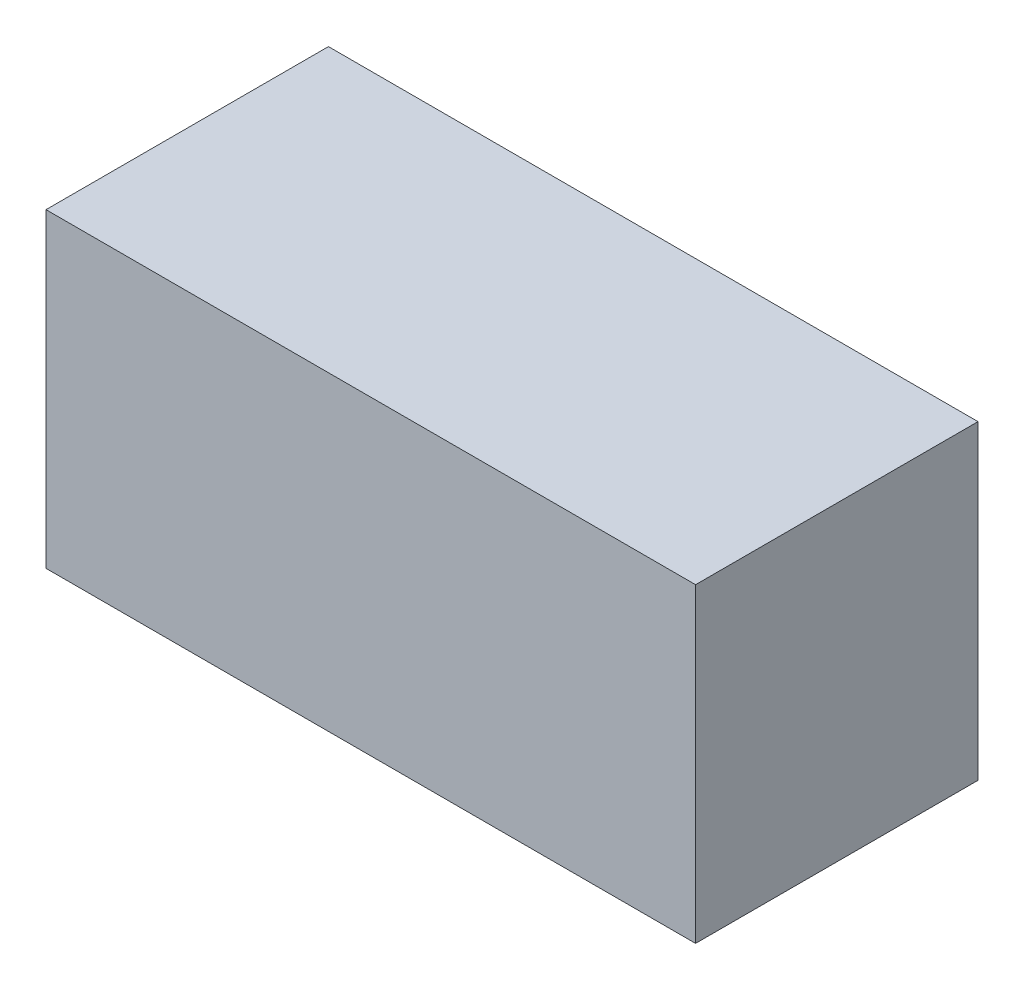
ISO-10303-21;
HEADER;
FILE_DESCRIPTION(('STEP AP214'),'2;1');
FILE_NAME('part.step','',(''),(''),'','','');
FILE_SCHEMA(('AUTOMOTIVE_DESIGN { 1 0 10303 214 1 1 1 1 }'));
ENDSEC;
DATA;
#1=APPLICATION_CONTEXT('core data for automotive mechanical design processes');
#2=APPLICATION_PROTOCOL_DEFINITION('international standard','automotive_design',2000,#1);
#3=PRODUCT_CONTEXT('',#1,'mechanical');
#4=PRODUCT('Part','Part','',(#3));
#5=PRODUCT_RELATED_PRODUCT_CATEGORY('part','',(#4));
#6=PRODUCT_DEFINITION_FORMATION('','',#4);
#7=PRODUCT_DEFINITION_CONTEXT('part definition',#1,'design');
#8=PRODUCT_DEFINITION('design','',#6,#7);
#9=PRODUCT_DEFINITION_SHAPE('','',#8);
#10=(LENGTH_UNIT() NAMED_UNIT(*) SI_UNIT(.MILLI.,.METRE.));
#11=(NAMED_UNIT(*) PLANE_ANGLE_UNIT() SI_UNIT($,.RADIAN.));
#12=(NAMED_UNIT(*) SI_UNIT($,.STERADIAN.) SOLID_ANGLE_UNIT());
#13=UNCERTAINTY_MEASURE_WITH_UNIT(LENGTH_MEASURE(1.E-05),#10,'distance_accuracy_value','');
#14=(GEOMETRIC_REPRESENTATION_CONTEXT(3) GLOBAL_UNCERTAINTY_ASSIGNED_CONTEXT((#13)) GLOBAL_UNIT_ASSIGNED_CONTEXT((#10,
#11,#12)) REPRESENTATION_CONTEXT('',''));
#15=CARTESIAN_POINT('',(0.,0.,0.));
#16=DIRECTION('',(0.,0.,1.));
#17=DIRECTION('',(1.,0.,0.));
#18=AXIS2_PLACEMENT_3D('',#15,#16,#17);
#19=CARTESIAN_POINT('',(-0.57500012,-0.27500072,0.499999));
#20=DIRECTION('',(0.,0.,1.));
#21=DIRECTION('',(1.,0.,0.));
#22=AXIS2_PLACEMENT_3D('',#19,#20,#21);
#23=PLANE('',#22);
#24=DIRECTION('',(1.,0.,0.));
#25=VECTOR('',#24,1.);
#26=CARTESIAN_POINT('',(-0.57500012,0.27499818,0.499999));
#27=LINE('',#26,#25);
#28=CARTESIAN_POINT('',(-0.57500012,0.27499818,0.499999));
#29=VERTEX_POINT('',#28);
#30=CARTESIAN_POINT('',(0.57499758,0.27499818,0.499999));
#31=VERTEX_POINT('',#30);
#32=EDGE_CURVE('E53',#29,#31,#27,.T.);
#33=ORIENTED_EDGE('',*,*,#32,.F.);
#34=DIRECTION('',(0.,1.,0.));
#35=VECTOR('',#34,1.);
#36=CARTESIAN_POINT('',(-0.57500012,-0.27500072,0.499999));
#37=LINE('',#36,#35);
#38=CARTESIAN_POINT('',(-0.57500012,-0.27500072,0.499999));
#39=VERTEX_POINT('',#38);
#40=EDGE_CURVE('E68',#39,#29,#37,.T.);
#41=ORIENTED_EDGE('',*,*,#40,.F.);
#42=DIRECTION('',(1.,0.,0.));
#43=VECTOR('',#42,1.);
#44=CARTESIAN_POINT('',(0.57499758,-0.27500072,0.499999));
#45=LINE('',#44,#43);
#46=CARTESIAN_POINT('',(0.57499758,-0.27500072,0.499999));
#47=VERTEX_POINT('',#46);
#48=EDGE_CURVE('E20',#47,#39,#45,.F.);
#49=ORIENTED_EDGE('',*,*,#48,.F.);
#50=DIRECTION('',(0.,1.,0.));
#51=VECTOR('',#50,1.);
#52=CARTESIAN_POINT('',(0.57499758,0.27499818,0.499999));
#53=LINE('',#52,#51);
#54=EDGE_CURVE('E58',#31,#47,#53,.F.);
#55=ORIENTED_EDGE('',*,*,#54,.F.);
#56=EDGE_LOOP('',(#33,#41,#49,#55));
#57=FACE_BOUND('',#56,.T.);
#58=ADVANCED_FACE('F17',(#57),#23,.T.);
#59=CARTESIAN_POINT('',(0.57499758,-0.27500072,0.));
#60=DIRECTION('',(0.,-1.,0.));
#61=DIRECTION('',(0.,0.,-1.));
#62=AXIS2_PLACEMENT_3D('',#59,#60,#61);
#63=PLANE('',#62);
#64=DIRECTION('',(0.,0.,1.));
#65=VECTOR('',#64,1.);
#66=CARTESIAN_POINT('',(-0.57500012,-0.27500072,0.));
#67=LINE('',#66,#65);
#68=CARTESIAN_POINT('',(-0.57500012,-0.27500072,0.));
#69=VERTEX_POINT('',#68);
#70=EDGE_CURVE('E79',#69,#39,#67,.T.);
#71=ORIENTED_EDGE('',*,*,#70,.F.);
#72=DIRECTION('',(1.,0.,0.));
#73=VECTOR('',#72,1.);
#74=CARTESIAN_POINT('',(-0.57500012,-0.27500072,0.));
#75=LINE('',#74,#73);
#76=CARTESIAN_POINT('',(0.57499758,-0.27500072,0.));
#77=VERTEX_POINT('',#76);
#78=EDGE_CURVE('E74',#69,#77,#75,.T.);
#79=ORIENTED_EDGE('',*,*,#78,.T.);
#80=DIRECTION('',(0.,0.,-1.));
#81=VECTOR('',#80,1.);
#82=CARTESIAN_POINT('',(0.57499758,-0.27500072,0.));
#83=LINE('',#82,#81);
#84=EDGE_CURVE('E63',#47,#77,#83,.T.);
#85=ORIENTED_EDGE('',*,*,#84,.F.);
#86=ORIENTED_EDGE('',*,*,#48,.T.);
#87=EDGE_LOOP('',(#71,#79,#85,#86));
#88=FACE_BOUND('',#87,.T.);
#89=ADVANCED_FACE('F73',(#88),#63,.T.);
#90=CARTESIAN_POINT('',(0.57499758,0.27499818,0.));
#91=DIRECTION('',(1.,0.,0.));
#92=DIRECTION('',(0.,0.,-1.));
#93=AXIS2_PLACEMENT_3D('',#90,#91,#92);
#94=PLANE('',#93);
#95=ORIENTED_EDGE('',*,*,#84,.T.);
#96=DIRECTION('',(0.,1.,0.));
#97=VECTOR('',#96,1.);
#98=CARTESIAN_POINT('',(0.57499758,-0.27500072,0.));
#99=LINE('',#98,#97);
#100=CARTESIAN_POINT('',(0.57499758,0.27499818,0.));
#101=VERTEX_POINT('',#100);
#102=EDGE_CURVE('E84',#77,#101,#99,.T.);
#103=ORIENTED_EDGE('',*,*,#102,.T.);
#104=DIRECTION('',(0.,0.,1.));
#105=VECTOR('',#104,1.);
#106=CARTESIAN_POINT('',(0.57499758,0.27499818,0.));
#107=LINE('',#106,#105);
#108=EDGE_CURVE('E65',#31,#101,#107,.F.);
#109=ORIENTED_EDGE('',*,*,#108,.F.);
#110=ORIENTED_EDGE('',*,*,#54,.T.);
#111=EDGE_LOOP('',(#95,#103,#109,#110));
#112=FACE_BOUND('',#111,.T.);
#113=ADVANCED_FACE('F60',(#112),#94,.T.);
#114=CARTESIAN_POINT('',(-0.57500012,0.27499818,0.));
#115=DIRECTION('',(0.,1.,0.));
#116=DIRECTION('',(0.,0.,1.));
#117=AXIS2_PLACEMENT_3D('',#114,#115,#116);
#118=PLANE('',#117);
#119=ORIENTED_EDGE('',*,*,#108,.T.);
#120=DIRECTION('',(1.,0.,0.));
#121=VECTOR('',#120,1.);
#122=CARTESIAN_POINT('',(-0.57500012,0.27499818,0.));
#123=LINE('',#122,#121);
#124=CARTESIAN_POINT('',(-0.57500012,0.27499818,0.));
#125=VERTEX_POINT('',#124);
#126=EDGE_CURVE('E26',#101,#125,#123,.F.);
#127=ORIENTED_EDGE('',*,*,#126,.T.);
#128=DIRECTION('',(0.,0.,1.));
#129=VECTOR('',#128,1.);
#130=CARTESIAN_POINT('',(-0.57500012,0.27499818,0.));
#131=LINE('',#130,#129);
#132=EDGE_CURVE('E34',#29,#125,#131,.F.);
#133=ORIENTED_EDGE('',*,*,#132,.F.);
#134=ORIENTED_EDGE('',*,*,#32,.T.);
#135=EDGE_LOOP('',(#119,#127,#133,#134));
#136=FACE_BOUND('',#135,.T.);
#137=ADVANCED_FACE('F88',(#136),#118,.T.);
#138=CARTESIAN_POINT('',(-0.57500012,-0.27500072,0.));
#139=DIRECTION('',(-1.,0.,0.));
#140=DIRECTION('',(0.,0.,1.));
#141=AXIS2_PLACEMENT_3D('',#138,#139,#140);
#142=PLANE('',#141);
#143=ORIENTED_EDGE('',*,*,#132,.T.);
#144=DIRECTION('',(0.,1.,0.));
#145=VECTOR('',#144,1.);
#146=CARTESIAN_POINT('',(-0.57500012,-0.27500072,0.));
#147=LINE('',#146,#145);
#148=EDGE_CURVE('E11',#125,#69,#147,.F.);
#149=ORIENTED_EDGE('',*,*,#148,.T.);
#150=ORIENTED_EDGE('',*,*,#70,.T.);
#151=ORIENTED_EDGE('',*,*,#40,.T.);
#152=EDGE_LOOP('',(#143,#149,#150,#151));
#153=FACE_BOUND('',#152,.T.);
#154=ADVANCED_FACE('F91',(#153),#142,.T.);
#155=CARTESIAN_POINT('',(-0.57500012,-0.27500072,0.));
#156=DIRECTION('',(0.,0.,1.));
#157=DIRECTION('',(1.,0.,0.));
#158=AXIS2_PLACEMENT_3D('',#155,#156,#157);
#159=PLANE('',#158);
#160=ORIENTED_EDGE('',*,*,#126,.F.);
#161=ORIENTED_EDGE('',*,*,#102,.F.);
#162=ORIENTED_EDGE('',*,*,#78,.F.);
#163=ORIENTED_EDGE('',*,*,#148,.F.);
#164=EDGE_LOOP('',(#160,#161,#162,#163));
#165=FACE_BOUND('',#164,.T.);
#166=ADVANCED_FACE('F90',(#165),#159,.F.);
#167=CLOSED_SHELL('',(#58,#89,#113,#137,#154,#166));
#168=MANIFOLD_SOLID_BREP('B1',#167);
#169=ADVANCED_BREP_SHAPE_REPRESENTATION('',(#18,#168),#14);
#170=SHAPE_DEFINITION_REPRESENTATION(#9,#169);
ENDSEC;
END-ISO-10303-21;
